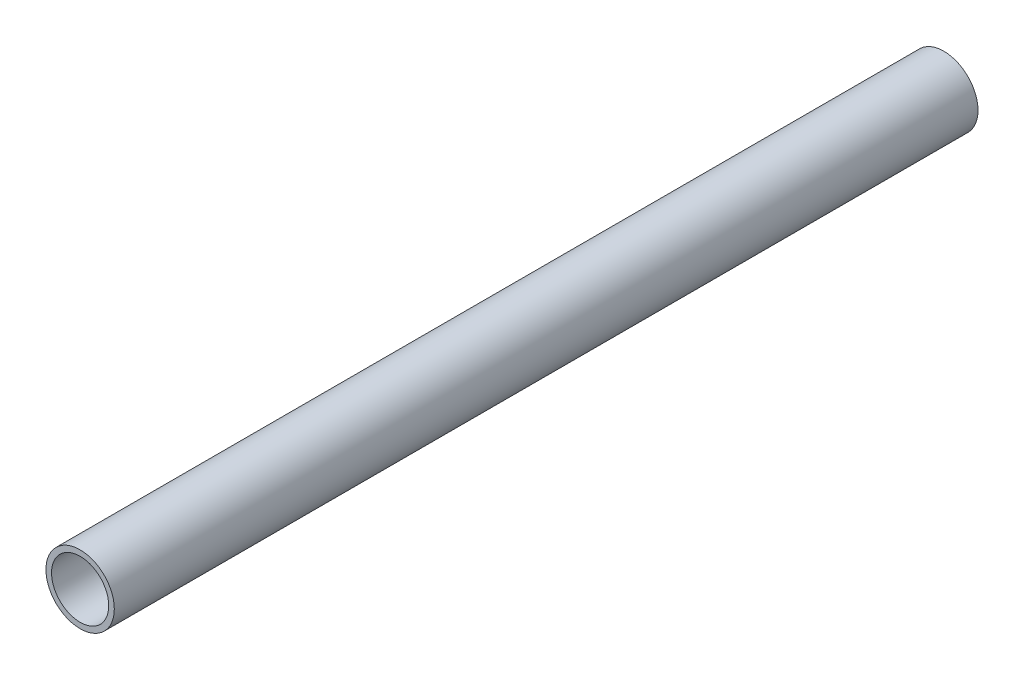
ISO-10303-21;
HEADER;
FILE_DESCRIPTION(('STEP AP214'),'2;1');
FILE_NAME('part.step','',(''),(''),'','','');
FILE_SCHEMA(('AUTOMOTIVE_DESIGN { 1 0 10303 214 1 1 1 1 }'));
ENDSEC;
DATA;
#1=APPLICATION_CONTEXT('core data for automotive mechanical design processes');
#2=APPLICATION_PROTOCOL_DEFINITION('international standard','automotive_design',2000,#1);
#3=PRODUCT_CONTEXT('',#1,'mechanical');
#4=PRODUCT('Part','Part','',(#3));
#5=PRODUCT_RELATED_PRODUCT_CATEGORY('part','',(#4));
#6=PRODUCT_DEFINITION_FORMATION('','',#4);
#7=PRODUCT_DEFINITION_CONTEXT('part definition',#1,'design');
#8=PRODUCT_DEFINITION('design','',#6,#7);
#9=PRODUCT_DEFINITION_SHAPE('','',#8);
#10=(LENGTH_UNIT() NAMED_UNIT(*) SI_UNIT(.MILLI.,.METRE.));
#11=(NAMED_UNIT(*) PLANE_ANGLE_UNIT() SI_UNIT($,.RADIAN.));
#12=(NAMED_UNIT(*) SI_UNIT($,.STERADIAN.) SOLID_ANGLE_UNIT());
#13=UNCERTAINTY_MEASURE_WITH_UNIT(LENGTH_MEASURE(1.E-05),#10,'distance_accuracy_value','');
#14=(GEOMETRIC_REPRESENTATION_CONTEXT(3) GLOBAL_UNCERTAINTY_ASSIGNED_CONTEXT((#13)) GLOBAL_UNIT_ASSIGNED_CONTEXT((#10,
#11,#12)) REPRESENTATION_CONTEXT('',''));
#15=CARTESIAN_POINT('',(0.,0.,0.));
#16=DIRECTION('',(0.,0.,1.));
#17=DIRECTION('',(1.,0.,0.));
#18=AXIS2_PLACEMENT_3D('',#15,#16,#17);
#19=CARTESIAN_POINT('',(0.,0.,609.6));
#20=DIRECTION('',(0.,0.,1.));
#21=DIRECTION('',(1.,0.,0.));
#22=AXIS2_PLACEMENT_3D('',#19,#20,#21);
#23=PLANE('',#22);
#24=CARTESIAN_POINT('',(0.,0.,609.6));
#25=DIRECTION('',(0.,0.,1.));
#26=DIRECTION('',(1.,0.,0.));
#27=AXIS2_PLACEMENT_3D('',#24,#25,#26);
#28=CIRCLE('',#27,24.13);
#29=CARTESIAN_POINT('',(24.13,0.,609.6));
#30=VERTEX_POINT('',#29);
#31=EDGE_CURVE('E10',#30,#30,#28,.T.);
#32=ORIENTED_EDGE('',*,*,#31,.T.);
#33=EDGE_LOOP('',(#32));
#34=FACE_BOUND('',#33,.T.);
#35=CARTESIAN_POINT('',(0.,0.,609.6));
#36=DIRECTION('',(0.,0.,1.));
#37=DIRECTION('',(1.,0.,0.));
#38=AXIS2_PLACEMENT_3D('',#35,#36,#37);
#39=CIRCLE('',#38,20.193);
#40=CARTESIAN_POINT('',(20.193,0.,609.6));
#41=VERTEX_POINT('',#40);
#42=EDGE_CURVE('E46',#41,#41,#39,.T.);
#43=ORIENTED_EDGE('',*,*,#42,.F.);
#44=EDGE_LOOP('',(#43));
#45=FACE_BOUND('',#44,.T.);
#46=ADVANCED_FACE('F35',(#34,#45),#23,.T.);
#47=CARTESIAN_POINT('',(0.,0.,0.));
#48=DIRECTION('',(0.,0.,1.));
#49=DIRECTION('',(1.,0.,0.));
#50=AXIS2_PLACEMENT_3D('',#47,#48,#49);
#51=PLANE('',#50);
#52=CARTESIAN_POINT('',(0.,0.,0.));
#53=DIRECTION('',(0.,0.,1.));
#54=DIRECTION('',(1.,0.,0.));
#55=AXIS2_PLACEMENT_3D('',#52,#53,#54);
#56=CIRCLE('',#55,24.13);
#57=CARTESIAN_POINT('',(24.13,0.,0.));
#58=VERTEX_POINT('',#57);
#59=EDGE_CURVE('E39',#58,#58,#56,.T.);
#60=ORIENTED_EDGE('',*,*,#59,.F.);
#61=EDGE_LOOP('',(#60));
#62=FACE_BOUND('',#61,.T.);
#63=CARTESIAN_POINT('',(0.,0.,0.));
#64=DIRECTION('',(0.,0.,1.));
#65=DIRECTION('',(1.,0.,0.));
#66=AXIS2_PLACEMENT_3D('',#63,#64,#65);
#67=CIRCLE('',#66,20.193);
#68=CARTESIAN_POINT('',(20.193,0.,0.));
#69=VERTEX_POINT('',#68);
#70=EDGE_CURVE('E48',#69,#69,#67,.T.);
#71=ORIENTED_EDGE('',*,*,#70,.T.);
#72=EDGE_LOOP('',(#71));
#73=FACE_BOUND('',#72,.T.);
#74=ADVANCED_FACE('F58',(#62,#73),#51,.F.);
#75=CARTESIAN_POINT('',(0.,0.,609.6));
#76=DIRECTION('',(0.,0.,-1.));
#77=DIRECTION('',(-1.,0.,0.));
#78=AXIS2_PLACEMENT_3D('',#75,#76,#77);
#79=CYLINDRICAL_SURFACE('',#78,24.13);
#80=ORIENTED_EDGE('',*,*,#31,.F.);
#81=EDGE_LOOP('',(#80));
#82=FACE_BOUND('',#81,.T.);
#83=ORIENTED_EDGE('',*,*,#59,.T.);
#84=EDGE_LOOP('',(#83));
#85=FACE_BOUND('',#84,.T.);
#86=ADVANCED_FACE('F37',(#82,#85),#79,.T.);
#87=CARTESIAN_POINT('',(0.,0.,609.6));
#88=DIRECTION('',(0.,0.,-1.));
#89=DIRECTION('',(-1.,0.,0.));
#90=AXIS2_PLACEMENT_3D('',#87,#88,#89);
#91=CYLINDRICAL_SURFACE('',#90,20.193);
#92=ORIENTED_EDGE('',*,*,#42,.T.);
#93=EDGE_LOOP('',(#92));
#94=FACE_BOUND('',#93,.T.);
#95=ORIENTED_EDGE('',*,*,#70,.F.);
#96=EDGE_LOOP('',(#95));
#97=FACE_BOUND('',#96,.T.);
#98=ADVANCED_FACE('F54',(#94,#97),#91,.F.);
#99=CLOSED_SHELL('',(#46,#74,#86,#98));
#100=MANIFOLD_SOLID_BREP('B2',#99);
#101=ADVANCED_BREP_SHAPE_REPRESENTATION('',(#18,#100),#14);
#102=SHAPE_DEFINITION_REPRESENTATION(#9,#101);
ENDSEC;
END-ISO-10303-21;
